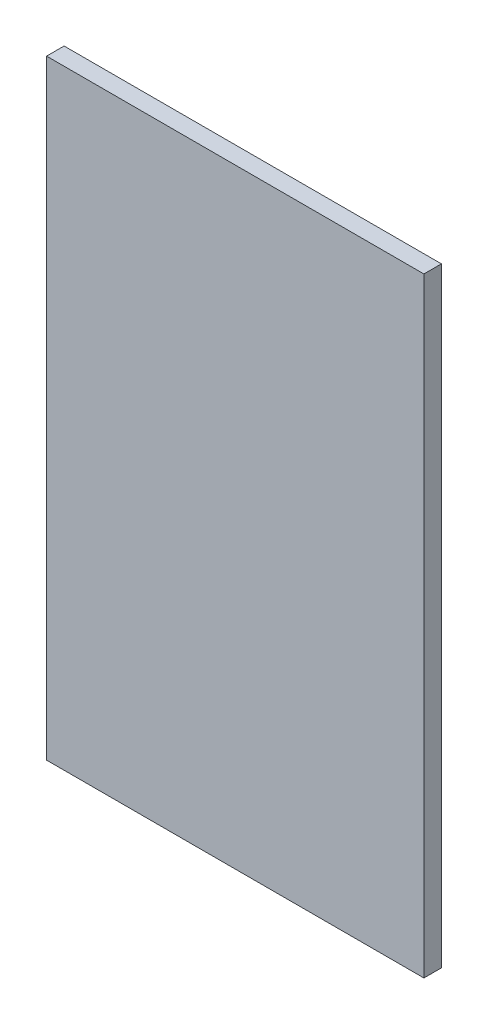
ISO-10303-21;
HEADER;
FILE_DESCRIPTION(('STEP AP214'),'2;1');
FILE_NAME('part.step','',(''),(''),'','','');
FILE_SCHEMA(('AUTOMOTIVE_DESIGN { 1 0 10303 214 1 1 1 1 }'));
ENDSEC;
DATA;
#1=APPLICATION_CONTEXT('core data for automotive mechanical design processes');
#2=APPLICATION_PROTOCOL_DEFINITION('international standard','automotive_design',2000,#1);
#3=PRODUCT_CONTEXT('',#1,'mechanical');
#4=PRODUCT('Part','Part','',(#3));
#5=PRODUCT_RELATED_PRODUCT_CATEGORY('part','',(#4));
#6=PRODUCT_DEFINITION_FORMATION('','',#4);
#7=PRODUCT_DEFINITION_CONTEXT('part definition',#1,'design');
#8=PRODUCT_DEFINITION('design','',#6,#7);
#9=PRODUCT_DEFINITION_SHAPE('','',#8);
#10=(LENGTH_UNIT() NAMED_UNIT(*) SI_UNIT(.MILLI.,.METRE.));
#11=(NAMED_UNIT(*) PLANE_ANGLE_UNIT() SI_UNIT($,.RADIAN.));
#12=(NAMED_UNIT(*) SI_UNIT($,.STERADIAN.) SOLID_ANGLE_UNIT());
#13=UNCERTAINTY_MEASURE_WITH_UNIT(LENGTH_MEASURE(1.E-05),#10,'distance_accuracy_value','');
#14=(GEOMETRIC_REPRESENTATION_CONTEXT(3) GLOBAL_UNCERTAINTY_ASSIGNED_CONTEXT((#13)) GLOBAL_UNIT_ASSIGNED_CONTEXT((#10,
#11,#12)) REPRESENTATION_CONTEXT('',''));
#15=CARTESIAN_POINT('',(0.,0.,0.));
#16=DIRECTION('',(0.,0.,1.));
#17=DIRECTION('',(1.,0.,0.));
#18=AXIS2_PLACEMENT_3D('',#15,#16,#17);
#19=CARTESIAN_POINT('',(-194.,-313.5,18.));
#20=DIRECTION('',(1.,0.,0.));
#21=DIRECTION('',(0.,0.,-1.));
#22=AXIS2_PLACEMENT_3D('',#19,#20,#21);
#23=PLANE('',#22);
#24=DIRECTION('',(0.,-1.,0.));
#25=VECTOR('',#24,1.);
#26=CARTESIAN_POINT('',(-194.,-313.5,0.));
#27=LINE('',#26,#25);
#28=CARTESIAN_POINT('',(-194.,313.5,0.));
#29=VERTEX_POINT('',#28);
#30=CARTESIAN_POINT('',(-194.,-313.5,0.));
#31=VERTEX_POINT('',#30);
#32=EDGE_CURVE('E95',#29,#31,#27,.T.);
#33=ORIENTED_EDGE('',*,*,#32,.T.);
#34=DIRECTION('',(0.,0.,-1.));
#35=VECTOR('',#34,1.);
#36=CARTESIAN_POINT('',(-194.,-313.5,18.));
#37=LINE('',#36,#35);
#38=CARTESIAN_POINT('',(-194.,-313.5,18.));
#39=VERTEX_POINT('',#38);
#40=EDGE_CURVE('E11',#39,#31,#37,.T.);
#41=ORIENTED_EDGE('',*,*,#40,.F.);
#42=DIRECTION('',(0.,-1.,0.));
#43=VECTOR('',#42,1.);
#44=CARTESIAN_POINT('',(-194.,-313.5,18.));
#45=LINE('',#44,#43);
#46=CARTESIAN_POINT('',(-194.,313.5,18.));
#47=VERTEX_POINT('',#46);
#48=EDGE_CURVE('E83',#47,#39,#45,.T.);
#49=ORIENTED_EDGE('',*,*,#48,.F.);
#50=DIRECTION('',(0.,0.,-1.));
#51=VECTOR('',#50,1.);
#52=CARTESIAN_POINT('',(-194.,313.5,18.));
#53=LINE('',#52,#51);
#54=EDGE_CURVE('E91',#47,#29,#53,.T.);
#55=ORIENTED_EDGE('',*,*,#54,.T.);
#56=EDGE_LOOP('',(#33,#41,#49,#55));
#57=FACE_BOUND('',#56,.T.);
#58=ADVANCED_FACE('F32',(#57),#23,.F.);
#59=CARTESIAN_POINT('',(194.,-313.5,18.));
#60=DIRECTION('',(0.,1.,0.));
#61=DIRECTION('',(0.,0.,1.));
#62=AXIS2_PLACEMENT_3D('',#59,#60,#61);
#63=PLANE('',#62);
#64=DIRECTION('',(1.,0.,0.));
#65=VECTOR('',#64,1.);
#66=CARTESIAN_POINT('',(194.,-313.5,0.));
#67=LINE('',#66,#65);
#68=CARTESIAN_POINT('',(194.,-313.5,0.));
#69=VERTEX_POINT('',#68);
#70=EDGE_CURVE('E87',#31,#69,#67,.T.);
#71=ORIENTED_EDGE('',*,*,#70,.T.);
#72=DIRECTION('',(0.,0.,-1.));
#73=VECTOR('',#72,1.);
#74=CARTESIAN_POINT('',(194.,-313.5,18.));
#75=LINE('',#74,#73);
#76=CARTESIAN_POINT('',(194.,-313.5,18.));
#77=VERTEX_POINT('',#76);
#78=EDGE_CURVE('E40',#77,#69,#75,.T.);
#79=ORIENTED_EDGE('',*,*,#78,.F.);
#80=DIRECTION('',(1.,0.,0.));
#81=VECTOR('',#80,1.);
#82=CARTESIAN_POINT('',(194.,-313.5,18.));
#83=LINE('',#82,#81);
#84=EDGE_CURVE('E78',#39,#77,#83,.T.);
#85=ORIENTED_EDGE('',*,*,#84,.F.);
#86=ORIENTED_EDGE('',*,*,#40,.T.);
#87=EDGE_LOOP('',(#71,#79,#85,#86));
#88=FACE_BOUND('',#87,.T.);
#89=ADVANCED_FACE('F86',(#88),#63,.F.);
#90=CARTESIAN_POINT('',(194.,-313.5,18.));
#91=DIRECTION('',(-1.,0.,0.));
#92=DIRECTION('',(0.,0.,1.));
#93=AXIS2_PLACEMENT_3D('',#90,#91,#92);
#94=PLANE('',#93);
#95=DIRECTION('',(0.,1.,0.));
#96=VECTOR('',#95,1.);
#97=CARTESIAN_POINT('',(194.,-313.5,0.));
#98=LINE('',#97,#96);
#99=CARTESIAN_POINT('',(194.,313.5,0.));
#100=VERTEX_POINT('',#99);
#101=EDGE_CURVE('E65',#69,#100,#98,.T.);
#102=ORIENTED_EDGE('',*,*,#101,.T.);
#103=DIRECTION('',(0.,0.,-1.));
#104=VECTOR('',#103,1.);
#105=CARTESIAN_POINT('',(194.,313.5,18.));
#106=LINE('',#105,#104);
#107=CARTESIAN_POINT('',(194.,313.5,18.));
#108=VERTEX_POINT('',#107);
#109=EDGE_CURVE('E88',#108,#100,#106,.T.);
#110=ORIENTED_EDGE('',*,*,#109,.F.);
#111=DIRECTION('',(0.,1.,0.));
#112=VECTOR('',#111,1.);
#113=CARTESIAN_POINT('',(194.,-313.5,18.));
#114=LINE('',#113,#112);
#115=EDGE_CURVE('E81',#77,#108,#114,.T.);
#116=ORIENTED_EDGE('',*,*,#115,.F.);
#117=ORIENTED_EDGE('',*,*,#78,.T.);
#118=EDGE_LOOP('',(#102,#110,#116,#117));
#119=FACE_BOUND('',#118,.T.);
#120=ADVANCED_FACE('F89',(#119),#94,.F.);
#121=CARTESIAN_POINT('',(194.,313.5,18.));
#122=DIRECTION('',(0.,-1.,0.));
#123=DIRECTION('',(1.,0.,0.));
#124=AXIS2_PLACEMENT_3D('',#121,#122,#123);
#125=PLANE('',#124);
#126=DIRECTION('',(-1.,0.,0.));
#127=VECTOR('',#126,1.);
#128=CARTESIAN_POINT('',(194.,313.5,0.));
#129=LINE('',#128,#127);
#130=EDGE_CURVE('E71',#100,#29,#129,.T.);
#131=ORIENTED_EDGE('',*,*,#130,.T.);
#132=ORIENTED_EDGE('',*,*,#54,.F.);
#133=DIRECTION('',(-1.,0.,0.));
#134=VECTOR('',#133,1.);
#135=CARTESIAN_POINT('',(194.,313.5,18.));
#136=LINE('',#135,#134);
#137=EDGE_CURVE('E48',#108,#47,#136,.T.);
#138=ORIENTED_EDGE('',*,*,#137,.F.);
#139=ORIENTED_EDGE('',*,*,#109,.T.);
#140=EDGE_LOOP('',(#131,#132,#138,#139));
#141=FACE_BOUND('',#140,.T.);
#142=ADVANCED_FACE('F102',(#141),#125,.F.);
#143=CARTESIAN_POINT('',(0.,0.,18.));
#144=DIRECTION('',(0.,0.,1.));
#145=DIRECTION('',(1.,0.,0.));
#146=AXIS2_PLACEMENT_3D('',#143,#144,#145);
#147=PLANE('',#146);
#148=ORIENTED_EDGE('',*,*,#48,.T.);
#149=ORIENTED_EDGE('',*,*,#84,.T.);
#150=ORIENTED_EDGE('',*,*,#115,.T.);
#151=ORIENTED_EDGE('',*,*,#137,.T.);
#152=EDGE_LOOP('',(#148,#149,#150,#151));
#153=FACE_BOUND('',#152,.T.);
#154=ADVANCED_FACE('F79',(#153),#147,.T.);
#155=CARTESIAN_POINT('',(0.,0.,0.));
#156=DIRECTION('',(0.,0.,1.));
#157=DIRECTION('',(1.,0.,0.));
#158=AXIS2_PLACEMENT_3D('',#155,#156,#157);
#159=PLANE('',#158);
#160=ORIENTED_EDGE('',*,*,#32,.F.);
#161=ORIENTED_EDGE('',*,*,#130,.F.);
#162=ORIENTED_EDGE('',*,*,#101,.F.);
#163=ORIENTED_EDGE('',*,*,#70,.F.);
#164=EDGE_LOOP('',(#160,#161,#162,#163));
#165=FACE_BOUND('',#164,.T.);
#166=ADVANCED_FACE('F105',(#165),#159,.F.);
#167=CLOSED_SHELL('',(#58,#89,#120,#142,#154,#166));
#168=MANIFOLD_SOLID_BREP('B2',#167);
#169=ADVANCED_BREP_SHAPE_REPRESENTATION('',(#18,#168),#14);
#170=SHAPE_DEFINITION_REPRESENTATION(#9,#169);
ENDSEC;
END-ISO-10303-21;
